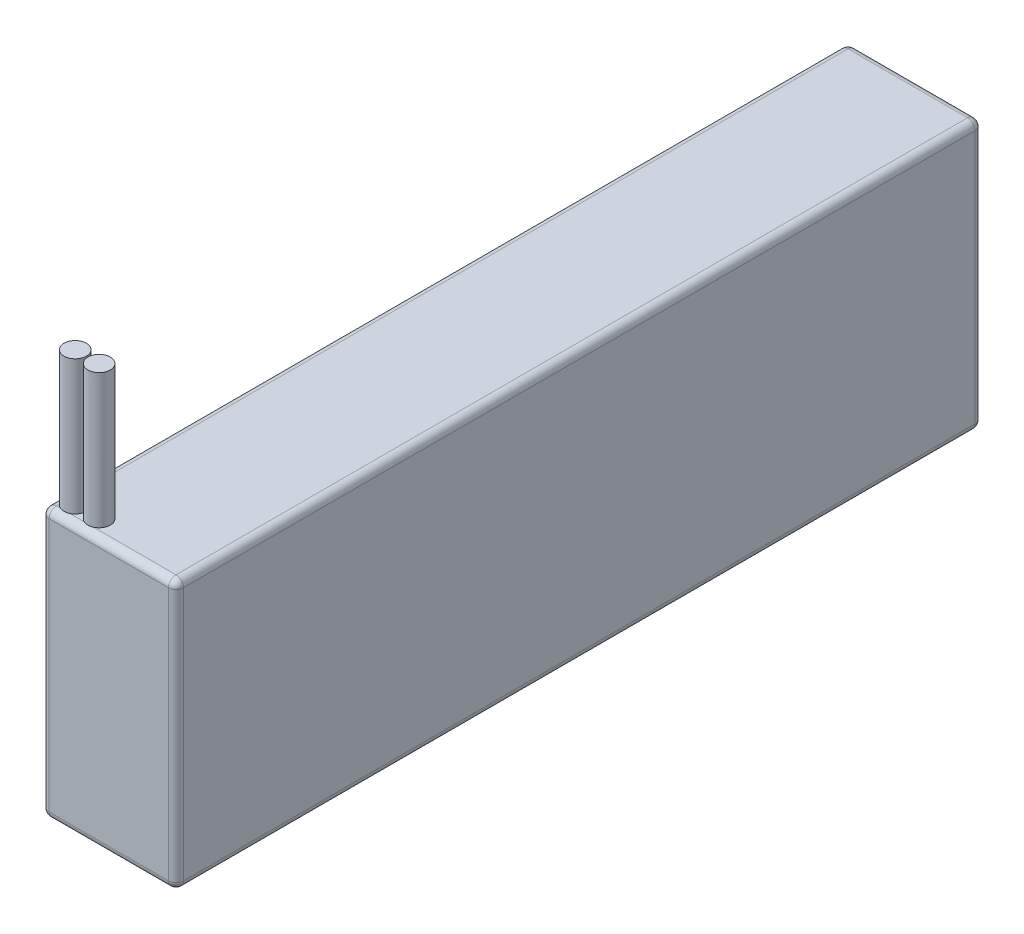
ISO-10303-21;
HEADER;
FILE_DESCRIPTION(('STEP AP214'),'2;1');
FILE_NAME('part.step','',(''),(''),'','','');
FILE_SCHEMA(('AUTOMOTIVE_DESIGN { 1 0 10303 214 1 1 1 1 }'));
ENDSEC;
DATA;
#1=APPLICATION_CONTEXT('core data for automotive mechanical design processes');
#2=APPLICATION_PROTOCOL_DEFINITION('international standard','automotive_design',2000,#1);
#3=PRODUCT_CONTEXT('',#1,'mechanical');
#4=PRODUCT('Part','Part','',(#3));
#5=PRODUCT_RELATED_PRODUCT_CATEGORY('part','',(#4));
#6=PRODUCT_DEFINITION_FORMATION('','',#4);
#7=PRODUCT_DEFINITION_CONTEXT('part definition',#1,'design');
#8=PRODUCT_DEFINITION('design','',#6,#7);
#9=PRODUCT_DEFINITION_SHAPE('','',#8);
#10=(LENGTH_UNIT() NAMED_UNIT(*) SI_UNIT(.MILLI.,.METRE.));
#11=(NAMED_UNIT(*) PLANE_ANGLE_UNIT() SI_UNIT($,.RADIAN.));
#12=(NAMED_UNIT(*) SI_UNIT($,.STERADIAN.) SOLID_ANGLE_UNIT());
#13=UNCERTAINTY_MEASURE_WITH_UNIT(LENGTH_MEASURE(1.E-05),#10,'distance_accuracy_value','');
#14=(GEOMETRIC_REPRESENTATION_CONTEXT(3) GLOBAL_UNCERTAINTY_ASSIGNED_CONTEXT((#13)) GLOBAL_UNIT_ASSIGNED_CONTEXT((#10,
#11,#12)) REPRESENTATION_CONTEXT('',''));
#15=CARTESIAN_POINT('',(0.,0.,0.));
#16=DIRECTION('',(0.,0.,1.));
#17=DIRECTION('',(1.,0.,0.));
#18=AXIS2_PLACEMENT_3D('',#15,#16,#17);
#19=CARTESIAN_POINT('',(22.86,22.86,68.58));
#20=DIRECTION('',(0.,-1.,0.));
#21=DIRECTION('',(0.,0.,-1.));
#22=AXIS2_PLACEMENT_3D('',#19,#20,#21);
#23=PLANE('',#22);
#24=CARTESIAN_POINT('',(2.72264453139453,22.86,65.5854179648613));
#25=DIRECTION('',(0.,1.,0.));
#26=DIRECTION('',(0.,0.,1.));
#27=AXIS2_PLACEMENT_3D('',#24,#25,#26);
#28=CIRCLE('',#27,1.905);
#29=CARTESIAN_POINT('',(1.27,22.86,66.8178338303099));
#30=VERTEX_POINT('',#29);
#31=CARTESIAN_POINT('',(1.91342156825225,22.86,67.31));
#32=VERTEX_POINT('',#31);
#33=EDGE_CURVE('E63',#30,#32,#28,.T.);
#34=ORIENTED_EDGE('',*,*,#33,.F.);
#35=DIRECTION('',(0.,0.,1.));
#36=VECTOR('',#35,1.);
#37=CARTESIAN_POINT('',(1.27,22.86,68.58));
#38=LINE('',#37,#36);
#39=CARTESIAN_POINT('',(1.27,22.86,67.31));
#40=VERTEX_POINT('',#39);
#41=EDGE_CURVE('E235',#30,#40,#38,.T.);
#42=ORIENTED_EDGE('',*,*,#41,.T.);
#43=DIRECTION('',(-1.,0.,0.));
#44=VECTOR('',#43,1.);
#45=CARTESIAN_POINT('',(22.86,22.86,67.31));
#46=LINE('',#45,#44);
#47=EDGE_CURVE('E158',#40,#32,#46,.F.);
#48=ORIENTED_EDGE('',*,*,#47,.T.);
#49=EDGE_LOOP('',(#34,#42,#48));
#50=FACE_BOUND('',#49,.T.);
#51=ADVANCED_FACE('F38',(#50),#23,.F.);
#52=CARTESIAN_POINT('',(22.86,-22.86,-68.58));
#53=DIRECTION('',(0.,0.,1.));
#54=DIRECTION('',(1.,0.,0.));
#55=AXIS2_PLACEMENT_3D('',#52,#53,#54);
#56=PLANE('',#55);
#57=DIRECTION('',(0.,1.,0.));
#58=VECTOR('',#57,1.);
#59=CARTESIAN_POINT('',(21.59,-22.86,-68.58));
#60=LINE('',#59,#58);
#61=CARTESIAN_POINT('',(21.59,21.59,-68.58));
#62=VERTEX_POINT('',#61);
#63=CARTESIAN_POINT('',(21.59,-21.59,-68.58));
#64=VERTEX_POINT('',#63);
#65=EDGE_CURVE('E230',#62,#64,#60,.F.);
#66=ORIENTED_EDGE('',*,*,#65,.T.);
#67=DIRECTION('',(-1.,0.,0.));
#68=VECTOR('',#67,1.);
#69=CARTESIAN_POINT('',(22.86,-21.59,-68.58));
#70=LINE('',#69,#68);
#71=CARTESIAN_POINT('',(1.27,-21.59,-68.58));
#72=VERTEX_POINT('',#71);
#73=EDGE_CURVE('E232',#64,#72,#70,.T.);
#74=ORIENTED_EDGE('',*,*,#73,.T.);
#75=DIRECTION('',(0.,1.,0.));
#76=VECTOR('',#75,1.);
#77=CARTESIAN_POINT('',(1.27,22.86,-68.58));
#78=LINE('',#77,#76);
#79=CARTESIAN_POINT('',(1.27,21.59,-68.58));
#80=VERTEX_POINT('',#79);
#81=EDGE_CURVE('E228',#72,#80,#78,.T.);
#82=ORIENTED_EDGE('',*,*,#81,.T.);
#83=DIRECTION('',(-1.,0.,0.));
#84=VECTOR('',#83,1.);
#85=CARTESIAN_POINT('',(22.86,21.59,-68.58));
#86=LINE('',#85,#84);
#87=EDGE_CURVE('E226',#80,#62,#86,.F.);
#88=ORIENTED_EDGE('',*,*,#87,.T.);
#89=EDGE_LOOP('',(#66,#74,#82,#88));
#90=FACE_BOUND('',#89,.T.);
#91=ADVANCED_FACE('F352',(#90),#56,.F.);
#92=CARTESIAN_POINT('',(6.78664453139453,22.86,65.5854179648613));
#93=DIRECTION('',(0.,1.,0.));
#94=DIRECTION('',(0.,0.,1.));
#95=AXIS2_PLACEMENT_3D('',#92,#93,#94);
#96=CIRCLE('',#95,1.90500000000001);
#97=CARTESIAN_POINT('',(7.59586749453682,22.86,67.31));
#98=VERTEX_POINT('',#97);
#99=CARTESIAN_POINT('',(5.97742156825224,22.86,67.31));
#100=VERTEX_POINT('',#99);
#101=EDGE_CURVE('E160',#98,#100,#96,.T.);
#102=ORIENTED_EDGE('',*,*,#101,.F.);
#103=CARTESIAN_POINT('',(21.59,22.86,67.31));
#104=VERTEX_POINT('',#103);
#105=EDGE_CURVE('E146',#98,#104,#46,.F.);
#106=ORIENTED_EDGE('',*,*,#105,.T.);
#107=DIRECTION('',(0.,0.,1.));
#108=VECTOR('',#107,1.);
#109=CARTESIAN_POINT('',(21.59,22.86,68.58));
#110=LINE('',#109,#108);
#111=CARTESIAN_POINT('',(21.59,22.86,-67.31));
#112=VERTEX_POINT('',#111);
#113=EDGE_CURVE('E47',#104,#112,#110,.F.);
#114=ORIENTED_EDGE('',*,*,#113,.T.);
#115=DIRECTION('',(-1.,0.,0.));
#116=VECTOR('',#115,1.);
#117=CARTESIAN_POINT('',(22.86,22.86,-67.31));
#118=LINE('',#117,#116);
#119=CARTESIAN_POINT('',(1.27,22.86,-67.31));
#120=VERTEX_POINT('',#119);
#121=EDGE_CURVE('E11',#112,#120,#118,.T.);
#122=ORIENTED_EDGE('',*,*,#121,.T.);
#123=CARTESIAN_POINT('',(1.27,22.86,64.3530020994126));
#124=VERTEX_POINT('',#123);
#125=EDGE_CURVE('E156',#120,#124,#38,.T.);
#126=ORIENTED_EDGE('',*,*,#125,.T.);
#127=CARTESIAN_POINT('',(3.53186749453681,22.86,67.31));
#128=VERTEX_POINT('',#127);
#129=EDGE_CURVE('E180',#128,#124,#28,.T.);
#130=ORIENTED_EDGE('',*,*,#129,.F.);
#131=EDGE_CURVE('E163',#128,#100,#46,.F.);
#132=ORIENTED_EDGE('',*,*,#131,.T.);
#133=EDGE_LOOP('',(#102,#106,#114,#122,#126,#130,#132));
#134=FACE_BOUND('',#133,.T.);
#135=ADVANCED_FACE('F161',(#134),#23,.F.);
#136=CARTESIAN_POINT('',(22.86,-22.86,68.58));
#137=DIRECTION('',(0.,0.,-1.));
#138=DIRECTION('',(-1.,0.,0.));
#139=AXIS2_PLACEMENT_3D('',#136,#137,#138);
#140=PLANE('',#139);
#141=DIRECTION('',(-1.,0.,0.));
#142=VECTOR('',#141,1.);
#143=CARTESIAN_POINT('',(22.86,-21.59,68.58));
#144=LINE('',#143,#142);
#145=CARTESIAN_POINT('',(1.27,-21.59,68.58));
#146=VERTEX_POINT('',#145);
#147=CARTESIAN_POINT('',(21.59,-21.59,68.58));
#148=VERTEX_POINT('',#147);
#149=EDGE_CURVE('E221',#146,#148,#144,.F.);
#150=ORIENTED_EDGE('',*,*,#149,.T.);
#151=DIRECTION('',(0.,-1.,0.));
#152=VECTOR('',#151,1.);
#153=CARTESIAN_POINT('',(21.59,-22.86,68.58));
#154=LINE('',#153,#152);
#155=CARTESIAN_POINT('',(21.59,21.59,68.58));
#156=VERTEX_POINT('',#155);
#157=EDGE_CURVE('E223',#148,#156,#154,.F.);
#158=ORIENTED_EDGE('',*,*,#157,.T.);
#159=DIRECTION('',(-1.,0.,0.));
#160=VECTOR('',#159,1.);
#161=CARTESIAN_POINT('',(22.86,21.59,68.58));
#162=LINE('',#161,#160);
#163=CARTESIAN_POINT('',(1.27,21.59,68.58));
#164=VERTEX_POINT('',#163);
#165=EDGE_CURVE('E217',#156,#164,#162,.T.);
#166=ORIENTED_EDGE('',*,*,#165,.T.);
#167=DIRECTION('',(0.,-1.,0.));
#168=VECTOR('',#167,1.);
#169=CARTESIAN_POINT('',(1.27,-22.86,68.58));
#170=LINE('',#169,#168);
#171=EDGE_CURVE('E219',#164,#146,#170,.T.);
#172=ORIENTED_EDGE('',*,*,#171,.T.);
#173=EDGE_LOOP('',(#150,#158,#166,#172));
#174=FACE_BOUND('',#173,.T.);
#175=ADVANCED_FACE('F318',(#174),#140,.F.);
#176=CARTESIAN_POINT('',(22.86,-22.86,68.58));
#177=DIRECTION('',(0.,1.,0.));
#178=DIRECTION('',(0.,0.,1.));
#179=AXIS2_PLACEMENT_3D('',#176,#177,#178);
#180=PLANE('',#179);
#181=DIRECTION('',(0.,0.,-1.));
#182=VECTOR('',#181,1.);
#183=CARTESIAN_POINT('',(21.59,-22.86,68.58));
#184=LINE('',#183,#182);
#185=CARTESIAN_POINT('',(21.59,-22.86,-67.31));
#186=VERTEX_POINT('',#185);
#187=CARTESIAN_POINT('',(21.59,-22.86,67.31));
#188=VERTEX_POINT('',#187);
#189=EDGE_CURVE('E203',#186,#188,#184,.F.);
#190=ORIENTED_EDGE('',*,*,#189,.T.);
#191=DIRECTION('',(-1.,0.,0.));
#192=VECTOR('',#191,1.);
#193=CARTESIAN_POINT('',(22.86,-22.86,67.31));
#194=LINE('',#193,#192);
#195=CARTESIAN_POINT('',(1.27,-22.86,67.31));
#196=VERTEX_POINT('',#195);
#197=EDGE_CURVE('E206',#188,#196,#194,.T.);
#198=ORIENTED_EDGE('',*,*,#197,.T.);
#199=DIRECTION('',(0.,0.,-1.));
#200=VECTOR('',#199,1.);
#201=CARTESIAN_POINT('',(1.27,-22.86,-68.58));
#202=LINE('',#201,#200);
#203=CARTESIAN_POINT('',(1.27,-22.86,-67.31));
#204=VERTEX_POINT('',#203);
#205=EDGE_CURVE('E201',#196,#204,#202,.T.);
#206=ORIENTED_EDGE('',*,*,#205,.T.);
#207=DIRECTION('',(-1.,0.,0.));
#208=VECTOR('',#207,1.);
#209=CARTESIAN_POINT('',(22.86,-22.86,-67.31));
#210=LINE('',#209,#208);
#211=EDGE_CURVE('E198',#204,#186,#210,.F.);
#212=ORIENTED_EDGE('',*,*,#211,.T.);
#213=EDGE_LOOP('',(#190,#198,#206,#212));
#214=FACE_BOUND('',#213,.T.);
#215=ADVANCED_FACE('F386',(#214),#180,.F.);
#216=CARTESIAN_POINT('',(22.86,0.,0.));
#217=DIRECTION('',(-1.,0.,0.));
#218=DIRECTION('',(0.,0.,1.));
#219=AXIS2_PLACEMENT_3D('',#216,#217,#218);
#220=PLANE('',#219);
#221=DIRECTION('',(0.,-1.,0.));
#222=VECTOR('',#221,1.);
#223=CARTESIAN_POINT('',(22.86,0.,67.31));
#224=LINE('',#223,#222);
#225=CARTESIAN_POINT('',(22.86,21.59,67.31));
#226=VERTEX_POINT('',#225);
#227=CARTESIAN_POINT('',(22.86,-21.59,67.31));
#228=VERTEX_POINT('',#227);
#229=EDGE_CURVE('E193',#226,#228,#224,.T.);
#230=ORIENTED_EDGE('',*,*,#229,.T.);
#231=DIRECTION('',(0.,0.,-1.));
#232=VECTOR('',#231,1.);
#233=CARTESIAN_POINT('',(22.86,-21.59,0.));
#234=LINE('',#233,#232);
#235=CARTESIAN_POINT('',(22.86,-21.59,-67.31));
#236=VERTEX_POINT('',#235);
#237=EDGE_CURVE('E195',#228,#236,#234,.T.);
#238=ORIENTED_EDGE('',*,*,#237,.T.);
#239=DIRECTION('',(0.,1.,0.));
#240=VECTOR('',#239,1.);
#241=CARTESIAN_POINT('',(22.86,0.,-67.31));
#242=LINE('',#241,#240);
#243=CARTESIAN_POINT('',(22.86,21.59,-67.31));
#244=VERTEX_POINT('',#243);
#245=EDGE_CURVE('E190',#236,#244,#242,.T.);
#246=ORIENTED_EDGE('',*,*,#245,.T.);
#247=DIRECTION('',(0.,0.,1.));
#248=VECTOR('',#247,1.);
#249=CARTESIAN_POINT('',(22.86,21.59,0.));
#250=LINE('',#249,#248);
#251=EDGE_CURVE('E188',#244,#226,#250,.T.);
#252=ORIENTED_EDGE('',*,*,#251,.T.);
#253=EDGE_LOOP('',(#230,#238,#246,#252));
#254=FACE_BOUND('',#253,.T.);
#255=ADVANCED_FACE('F390',(#254),#220,.F.);
#256=CARTESIAN_POINT('',(0.,0.,0.));
#257=DIRECTION('',(-1.,0.,0.));
#258=DIRECTION('',(0.,0.,1.));
#259=AXIS2_PLACEMENT_3D('',#256,#257,#258);
#260=PLANE('',#259);
#261=DIRECTION('',(0.,1.,0.));
#262=VECTOR('',#261,1.);
#263=CARTESIAN_POINT('',(0.,-22.86,-67.31));
#264=LINE('',#263,#262);
#265=CARTESIAN_POINT('',(0.,21.59,-67.31));
#266=VERTEX_POINT('',#265);
#267=CARTESIAN_POINT('',(0.,-21.59,-67.31));
#268=VERTEX_POINT('',#267);
#269=EDGE_CURVE('E210',#266,#268,#264,.F.);
#270=ORIENTED_EDGE('',*,*,#269,.T.);
#271=DIRECTION('',(0.,0.,-1.));
#272=VECTOR('',#271,1.);
#273=CARTESIAN_POINT('',(0.,-21.59,68.58));
#274=LINE('',#273,#272);
#275=CARTESIAN_POINT('',(0.,-21.59,67.31));
#276=VERTEX_POINT('',#275);
#277=EDGE_CURVE('E214',#268,#276,#274,.F.);
#278=ORIENTED_EDGE('',*,*,#277,.T.);
#279=DIRECTION('',(0.,-1.,0.));
#280=VECTOR('',#279,1.);
#281=CARTESIAN_POINT('',(0.,22.86,67.31));
#282=LINE('',#281,#280);
#283=CARTESIAN_POINT('',(0.,21.59,67.31));
#284=VERTEX_POINT('',#283);
#285=EDGE_CURVE('E212',#276,#284,#282,.F.);
#286=ORIENTED_EDGE('',*,*,#285,.T.);
#287=DIRECTION('',(0.,0.,1.));
#288=VECTOR('',#287,1.);
#289=CARTESIAN_POINT('',(0.,21.59,-68.58));
#290=LINE('',#289,#288);
#291=EDGE_CURVE('E208',#284,#266,#290,.F.);
#292=ORIENTED_EDGE('',*,*,#291,.T.);
#293=EDGE_LOOP('',(#270,#278,#286,#292));
#294=FACE_BOUND('',#293,.T.);
#295=ADVANCED_FACE('F394',(#294),#260,.T.);
#296=CARTESIAN_POINT('',(1.27,21.59,68.58));
#297=DIRECTION('',(0.,0.,-1.));
#298=DIRECTION('',(-1.,0.,0.));
#299=AXIS2_PLACEMENT_3D('',#296,#297,#298);
#300=CYLINDRICAL_SURFACE('',#299,1.27);
#301=CARTESIAN_POINT('',(1.27,21.59,67.31));
#302=DIRECTION('',(0.,0.,1.));
#303=DIRECTION('',(1.,0.,0.));
#304=AXIS2_PLACEMENT_3D('',#301,#302,#303);
#305=CIRCLE('',#304,1.27);
#306=EDGE_CURVE('E42',#40,#284,#305,.T.);
#307=ORIENTED_EDGE('',*,*,#306,.F.);
#308=ORIENTED_EDGE('',*,*,#41,.F.);
#309=DIRECTION('',(0.,0.,-1.));
#310=VECTOR('',#309,1.);
#311=CARTESIAN_POINT('',(1.27,22.86,68.58));
#312=LINE('',#311,#310);
#313=EDGE_CURVE('E179',#124,#30,#312,.F.);
#314=ORIENTED_EDGE('',*,*,#313,.F.);
#315=ORIENTED_EDGE('',*,*,#125,.F.);
#316=CARTESIAN_POINT('',(1.27,21.59,-67.31));
#317=DIRECTION('',(0.,0.,-1.));
#318=DIRECTION('',(-1.,0.,0.));
#319=AXIS2_PLACEMENT_3D('',#316,#317,#318);
#320=CIRCLE('',#319,1.27);
#321=EDGE_CURVE('E295',#266,#120,#320,.T.);
#322=ORIENTED_EDGE('',*,*,#321,.F.);
#323=ORIENTED_EDGE('',*,*,#291,.F.);
#324=EDGE_LOOP('',(#307,#308,#314,#315,#322,#323));
#325=FACE_BOUND('',#324,.T.);
#326=ADVANCED_FACE('F40',(#325),#300,.T.);
#327=CARTESIAN_POINT('',(1.27,21.59,67.31));
#328=DIRECTION('',(0.,0.,1.));
#329=DIRECTION('',(1.,0.,0.));
#330=AXIS2_PLACEMENT_3D('',#327,#328,#329);
#331=SPHERICAL_SURFACE('',#330,1.27);
#332=CARTESIAN_POINT('',(1.27,21.59,67.31));
#333=DIRECTION('',(-1.,0.,0.));
#334=DIRECTION('',(0.,0.,1.));
#335=AXIS2_PLACEMENT_3D('',#332,#333,#334);
#336=CIRCLE('',#335,1.27);
#337=EDGE_CURVE('E291',#40,#164,#336,.F.);
#338=ORIENTED_EDGE('',*,*,#337,.F.);
#339=ORIENTED_EDGE('',*,*,#306,.T.);
#340=CARTESIAN_POINT('',(1.27,21.59,67.31));
#341=DIRECTION('',(0.,1.,0.));
#342=DIRECTION('',(0.,0.,1.));
#343=AXIS2_PLACEMENT_3D('',#340,#341,#342);
#344=CIRCLE('',#343,1.27);
#345=EDGE_CURVE('E293',#164,#284,#344,.F.);
#346=ORIENTED_EDGE('',*,*,#345,.F.);
#347=EDGE_LOOP('',(#338,#339,#346));
#348=FACE_BOUND('',#347,.T.);
#349=ADVANCED_FACE('F307',(#348),#331,.T.);
#350=CARTESIAN_POINT('',(1.27,21.59,-67.31));
#351=DIRECTION('',(0.,0.,1.));
#352=DIRECTION('',(1.,0.,0.));
#353=AXIS2_PLACEMENT_3D('',#350,#351,#352);
#354=SPHERICAL_SURFACE('',#353,1.27);
#355=CARTESIAN_POINT('',(1.27,21.59,-67.31));
#356=DIRECTION('',(0.,1.,0.));
#357=DIRECTION('',(0.,0.,1.));
#358=AXIS2_PLACEMENT_3D('',#355,#356,#357);
#359=CIRCLE('',#358,1.27);
#360=EDGE_CURVE('E286',#266,#80,#359,.F.);
#361=ORIENTED_EDGE('',*,*,#360,.F.);
#362=ORIENTED_EDGE('',*,*,#321,.T.);
#363=CARTESIAN_POINT('',(1.27,21.59,-67.31));
#364=DIRECTION('',(-1.,0.,0.));
#365=DIRECTION('',(0.,0.,1.));
#366=AXIS2_PLACEMENT_3D('',#363,#364,#365);
#367=CIRCLE('',#366,1.27);
#368=EDGE_CURVE('E289',#80,#120,#367,.F.);
#369=ORIENTED_EDGE('',*,*,#368,.F.);
#370=EDGE_LOOP('',(#361,#362,#369));
#371=FACE_BOUND('',#370,.T.);
#372=ADVANCED_FACE('F367',(#371),#354,.T.);
#373=CARTESIAN_POINT('',(1.27,-22.86,67.31));
#374=DIRECTION('',(0.,1.,0.));
#375=DIRECTION('',(0.,0.,1.));
#376=AXIS2_PLACEMENT_3D('',#373,#374,#375);
#377=CYLINDRICAL_SURFACE('',#376,1.27);
#378=ORIENTED_EDGE('',*,*,#345,.T.);
#379=ORIENTED_EDGE('',*,*,#285,.F.);
#380=CARTESIAN_POINT('',(1.27,-21.59,67.31));
#381=DIRECTION('',(0.,-1.,0.));
#382=DIRECTION('',(0.,0.,-1.));
#383=AXIS2_PLACEMENT_3D('',#380,#381,#382);
#384=CIRCLE('',#383,1.27);
#385=EDGE_CURVE('E281',#146,#276,#384,.T.);
#386=ORIENTED_EDGE('',*,*,#385,.F.);
#387=ORIENTED_EDGE('',*,*,#171,.F.);
#388=EDGE_LOOP('',(#378,#379,#386,#387));
#389=FACE_BOUND('',#388,.T.);
#390=ADVANCED_FACE('F314',(#389),#377,.T.);
#391=CARTESIAN_POINT('',(22.86,21.59,67.31));
#392=DIRECTION('',(-1.,0.,0.));
#393=DIRECTION('',(0.,0.,1.));
#394=AXIS2_PLACEMENT_3D('',#391,#392,#393);
#395=CYLINDRICAL_SURFACE('',#394,1.27);
#396=ORIENTED_EDGE('',*,*,#337,.T.);
#397=ORIENTED_EDGE('',*,*,#165,.F.);
#398=CARTESIAN_POINT('',(21.59,21.59,67.31));
#399=DIRECTION('',(1.,0.,0.));
#400=DIRECTION('',(0.,0.,-1.));
#401=AXIS2_PLACEMENT_3D('',#398,#399,#400);
#402=CIRCLE('',#401,1.27);
#403=EDGE_CURVE('E152',#104,#156,#402,.T.);
#404=ORIENTED_EDGE('',*,*,#403,.F.);
#405=ORIENTED_EDGE('',*,*,#105,.F.);
#406=EDGE_CURVE('E55',#100,#98,#46,.F.);
#407=ORIENTED_EDGE('',*,*,#406,.F.);
#408=ORIENTED_EDGE('',*,*,#131,.F.);
#409=EDGE_CURVE('E238',#32,#128,#46,.F.);
#410=ORIENTED_EDGE('',*,*,#409,.F.);
#411=ORIENTED_EDGE('',*,*,#47,.F.);
#412=EDGE_LOOP('',(#396,#397,#404,#405,#407,#408,#410,#411));
#413=FACE_BOUND('',#412,.T.);
#414=ADVANCED_FACE('F149',(#413),#395,.T.);
#415=CARTESIAN_POINT('',(21.59,21.59,0.));
#416=DIRECTION('',(0.,0.,1.));
#417=DIRECTION('',(1.,0.,0.));
#418=AXIS2_PLACEMENT_3D('',#415,#416,#417);
#419=CYLINDRICAL_SURFACE('',#418,1.27);
#420=CARTESIAN_POINT('',(21.59,21.59,-67.31));
#421=DIRECTION('',(0.,0.,-1.));
#422=DIRECTION('',(-1.,0.,0.));
#423=AXIS2_PLACEMENT_3D('',#420,#421,#422);
#424=CIRCLE('',#423,1.27);
#425=EDGE_CURVE('E274',#112,#244,#424,.T.);
#426=ORIENTED_EDGE('',*,*,#425,.F.);
#427=ORIENTED_EDGE('',*,*,#113,.F.);
#428=CARTESIAN_POINT('',(21.59,21.59,67.31));
#429=DIRECTION('',(0.,0.,1.));
#430=DIRECTION('',(1.,0.,0.));
#431=AXIS2_PLACEMENT_3D('',#428,#429,#430);
#432=CIRCLE('',#431,1.27);
#433=EDGE_CURVE('E277',#226,#104,#432,.T.);
#434=ORIENTED_EDGE('',*,*,#433,.F.);
#435=ORIENTED_EDGE('',*,*,#251,.F.);
#436=EDGE_LOOP('',(#426,#427,#434,#435));
#437=FACE_BOUND('',#436,.T.);
#438=ADVANCED_FACE('F341',(#437),#419,.T.);
#439=CARTESIAN_POINT('',(22.86,21.59,-67.31));
#440=DIRECTION('',(-1.,0.,0.));
#441=DIRECTION('',(0.,0.,1.));
#442=AXIS2_PLACEMENT_3D('',#439,#440,#441);
#443=CYLINDRICAL_SURFACE('',#442,1.27);
#444=ORIENTED_EDGE('',*,*,#368,.T.);
#445=ORIENTED_EDGE('',*,*,#121,.F.);
#446=CARTESIAN_POINT('',(21.59,21.59,-67.31));
#447=DIRECTION('',(1.,0.,0.));
#448=DIRECTION('',(0.,0.,-1.));
#449=AXIS2_PLACEMENT_3D('',#446,#447,#448);
#450=CIRCLE('',#449,1.27);
#451=EDGE_CURVE('E271',#62,#112,#450,.T.);
#452=ORIENTED_EDGE('',*,*,#451,.F.);
#453=ORIENTED_EDGE('',*,*,#87,.F.);
#454=EDGE_LOOP('',(#444,#445,#452,#453));
#455=FACE_BOUND('',#454,.T.);
#456=ADVANCED_FACE('F336',(#455),#443,.T.);
#457=CARTESIAN_POINT('',(1.27,-22.86,-67.31));
#458=DIRECTION('',(0.,-1.,0.));
#459=DIRECTION('',(0.,0.,-1.));
#460=AXIS2_PLACEMENT_3D('',#457,#458,#459);
#461=CYLINDRICAL_SURFACE('',#460,1.27);
#462=ORIENTED_EDGE('',*,*,#360,.T.);
#463=ORIENTED_EDGE('',*,*,#81,.F.);
#464=CARTESIAN_POINT('',(1.27,-21.59,-67.31));
#465=DIRECTION('',(0.,-1.,0.));
#466=DIRECTION('',(0.,0.,-1.));
#467=AXIS2_PLACEMENT_3D('',#464,#465,#466);
#468=CIRCLE('',#467,1.27);
#469=EDGE_CURVE('E268',#268,#72,#468,.T.);
#470=ORIENTED_EDGE('',*,*,#469,.F.);
#471=ORIENTED_EDGE('',*,*,#269,.F.);
#472=EDGE_LOOP('',(#462,#463,#470,#471));
#473=FACE_BOUND('',#472,.T.);
#474=ADVANCED_FACE('F366',(#473),#461,.T.);
#475=CARTESIAN_POINT('',(1.27,-21.59,68.58));
#476=DIRECTION('',(0.,0.,1.));
#477=DIRECTION('',(1.,0.,0.));
#478=AXIS2_PLACEMENT_3D('',#475,#476,#477);
#479=CYLINDRICAL_SURFACE('',#478,1.27);
#480=CARTESIAN_POINT('',(1.27,-21.59,67.31));
#481=DIRECTION('',(0.,0.,1.));
#482=DIRECTION('',(1.,0.,0.));
#483=AXIS2_PLACEMENT_3D('',#480,#481,#482);
#484=CIRCLE('',#483,1.27);
#485=EDGE_CURVE('E283',#276,#196,#484,.T.);
#486=ORIENTED_EDGE('',*,*,#485,.F.);
#487=ORIENTED_EDGE('',*,*,#277,.F.);
#488=CARTESIAN_POINT('',(1.27,-21.59,-67.31));
#489=DIRECTION('',(0.,0.,-1.));
#490=DIRECTION('',(-1.,0.,0.));
#491=AXIS2_PLACEMENT_3D('',#488,#489,#490);
#492=CIRCLE('',#491,1.27);
#493=EDGE_CURVE('E265',#204,#268,#492,.T.);
#494=ORIENTED_EDGE('',*,*,#493,.F.);
#495=ORIENTED_EDGE('',*,*,#205,.F.);
#496=EDGE_LOOP('',(#486,#487,#494,#495));
#497=FACE_BOUND('',#496,.T.);
#498=ADVANCED_FACE('F517',(#497),#479,.T.);
#499=CARTESIAN_POINT('',(1.27,-21.59,67.31));
#500=DIRECTION('',(0.,0.,1.));
#501=DIRECTION('',(1.,0.,0.));
#502=AXIS2_PLACEMENT_3D('',#499,#500,#501);
#503=SPHERICAL_SURFACE('',#502,1.27);
#504=ORIENTED_EDGE('',*,*,#385,.T.);
#505=ORIENTED_EDGE('',*,*,#485,.T.);
#506=CARTESIAN_POINT('',(1.27,-21.59,67.31));
#507=DIRECTION('',(-1.,0.,0.));
#508=DIRECTION('',(0.,0.,1.));
#509=AXIS2_PLACEMENT_3D('',#506,#507,#508);
#510=CIRCLE('',#509,1.27);
#511=EDGE_CURVE('E262',#146,#196,#510,.F.);
#512=ORIENTED_EDGE('',*,*,#511,.F.);
#513=EDGE_LOOP('',(#504,#505,#512));
#514=FACE_BOUND('',#513,.T.);
#515=ADVANCED_FACE('F525',(#514),#503,.T.);
#516=CARTESIAN_POINT('',(21.59,21.59,67.31));
#517=DIRECTION('',(0.,0.,1.));
#518=DIRECTION('',(1.,0.,0.));
#519=AXIS2_PLACEMENT_3D('',#516,#517,#518);
#520=SPHERICAL_SURFACE('',#519,1.27);
#521=ORIENTED_EDGE('',*,*,#433,.T.);
#522=ORIENTED_EDGE('',*,*,#403,.T.);
#523=CARTESIAN_POINT('',(21.59,21.59,67.31));
#524=DIRECTION('',(0.,1.,0.));
#525=DIRECTION('',(0.,0.,1.));
#526=AXIS2_PLACEMENT_3D('',#523,#524,#525);
#527=CIRCLE('',#526,1.27);
#528=EDGE_CURVE('E260',#226,#156,#527,.F.);
#529=ORIENTED_EDGE('',*,*,#528,.F.);
#530=EDGE_LOOP('',(#521,#522,#529));
#531=FACE_BOUND('',#530,.T.);
#532=ADVANCED_FACE('F534',(#531),#520,.T.);
#533=CARTESIAN_POINT('',(21.59,21.59,-67.31));
#534=DIRECTION('',(0.,0.,1.));
#535=DIRECTION('',(1.,0.,0.));
#536=AXIS2_PLACEMENT_3D('',#533,#534,#535);
#537=SPHERICAL_SURFACE('',#536,1.27);
#538=ORIENTED_EDGE('',*,*,#451,.T.);
#539=ORIENTED_EDGE('',*,*,#425,.T.);
#540=CARTESIAN_POINT('',(21.59,21.59,-67.31));
#541=DIRECTION('',(0.,1.,0.));
#542=DIRECTION('',(0.,0.,1.));
#543=AXIS2_PLACEMENT_3D('',#540,#541,#542);
#544=CIRCLE('',#543,1.27);
#545=EDGE_CURVE('E257',#62,#244,#544,.F.);
#546=ORIENTED_EDGE('',*,*,#545,.F.);
#547=EDGE_LOOP('',(#538,#539,#546));
#548=FACE_BOUND('',#547,.T.);
#549=ADVANCED_FACE('F344',(#548),#537,.T.);
#550=CARTESIAN_POINT('',(1.27,-21.59,-67.31));
#551=DIRECTION('',(0.,0.,1.));
#552=DIRECTION('',(1.,0.,0.));
#553=AXIS2_PLACEMENT_3D('',#550,#551,#552);
#554=SPHERICAL_SURFACE('',#553,1.27);
#555=ORIENTED_EDGE('',*,*,#493,.T.);
#556=ORIENTED_EDGE('',*,*,#469,.T.);
#557=CARTESIAN_POINT('',(1.27,-21.59,-67.31));
#558=DIRECTION('',(-1.,0.,0.));
#559=DIRECTION('',(0.,0.,1.));
#560=AXIS2_PLACEMENT_3D('',#557,#558,#559);
#561=CIRCLE('',#560,1.27);
#562=EDGE_CURVE('E255',#204,#72,#561,.F.);
#563=ORIENTED_EDGE('',*,*,#562,.F.);
#564=EDGE_LOOP('',(#555,#556,#563));
#565=FACE_BOUND('',#564,.T.);
#566=ADVANCED_FACE('F362',(#565),#554,.T.);
#567=CARTESIAN_POINT('',(22.86,-21.59,67.31));
#568=DIRECTION('',(-1.,0.,0.));
#569=DIRECTION('',(0.,0.,1.));
#570=AXIS2_PLACEMENT_3D('',#567,#568,#569);
#571=CYLINDRICAL_SURFACE('',#570,1.27);
#572=ORIENTED_EDGE('',*,*,#511,.T.);
#573=ORIENTED_EDGE('',*,*,#197,.F.);
#574=CARTESIAN_POINT('',(21.59,-21.59,67.31));
#575=DIRECTION('',(1.,0.,0.));
#576=DIRECTION('',(0.,0.,-1.));
#577=AXIS2_PLACEMENT_3D('',#574,#575,#576);
#578=CIRCLE('',#577,1.27);
#579=EDGE_CURVE('E252',#148,#188,#578,.T.);
#580=ORIENTED_EDGE('',*,*,#579,.F.);
#581=ORIENTED_EDGE('',*,*,#149,.F.);
#582=EDGE_LOOP('',(#572,#573,#580,#581));
#583=FACE_BOUND('',#582,.T.);
#584=ADVANCED_FACE('F558',(#583),#571,.T.);
#585=CARTESIAN_POINT('',(21.59,0.,67.31));
#586=DIRECTION('',(0.,-1.,0.));
#587=DIRECTION('',(0.,0.,-1.));
#588=AXIS2_PLACEMENT_3D('',#585,#586,#587);
#589=CYLINDRICAL_SURFACE('',#588,1.27);
#590=ORIENTED_EDGE('',*,*,#528,.T.);
#591=ORIENTED_EDGE('',*,*,#157,.F.);
#592=CARTESIAN_POINT('',(21.59,-21.59,67.31));
#593=DIRECTION('',(0.,-1.,0.));
#594=DIRECTION('',(0.,0.,-1.));
#595=AXIS2_PLACEMENT_3D('',#592,#593,#594);
#596=CIRCLE('',#595,1.27);
#597=EDGE_CURVE('E249',#228,#148,#596,.T.);
#598=ORIENTED_EDGE('',*,*,#597,.F.);
#599=ORIENTED_EDGE('',*,*,#229,.F.);
#600=EDGE_LOOP('',(#590,#591,#598,#599));
#601=FACE_BOUND('',#600,.T.);
#602=ADVANCED_FACE('F566',(#601),#589,.T.);
#603=CARTESIAN_POINT('',(21.59,0.,-67.31));
#604=DIRECTION('',(0.,1.,0.));
#605=DIRECTION('',(0.,0.,1.));
#606=AXIS2_PLACEMENT_3D('',#603,#604,#605);
#607=CYLINDRICAL_SURFACE('',#606,1.27);
#608=ORIENTED_EDGE('',*,*,#545,.T.);
#609=ORIENTED_EDGE('',*,*,#245,.F.);
#610=CARTESIAN_POINT('',(21.59,-21.59,-67.31));
#611=DIRECTION('',(0.,-1.,0.));
#612=DIRECTION('',(0.,0.,-1.));
#613=AXIS2_PLACEMENT_3D('',#610,#611,#612);
#614=CIRCLE('',#613,1.27);
#615=EDGE_CURVE('E246',#64,#236,#614,.T.);
#616=ORIENTED_EDGE('',*,*,#615,.F.);
#617=ORIENTED_EDGE('',*,*,#65,.F.);
#618=EDGE_LOOP('',(#608,#609,#616,#617));
#619=FACE_BOUND('',#618,.T.);
#620=ADVANCED_FACE('F349',(#619),#607,.T.);
#621=CARTESIAN_POINT('',(22.86,-21.59,-67.31));
#622=DIRECTION('',(-1.,0.,0.));
#623=DIRECTION('',(0.,0.,1.));
#624=AXIS2_PLACEMENT_3D('',#621,#622,#623);
#625=CYLINDRICAL_SURFACE('',#624,1.27);
#626=ORIENTED_EDGE('',*,*,#562,.T.);
#627=ORIENTED_EDGE('',*,*,#73,.F.);
#628=CARTESIAN_POINT('',(21.59,-21.59,-67.31));
#629=DIRECTION('',(1.,0.,0.));
#630=DIRECTION('',(0.,0.,-1.));
#631=AXIS2_PLACEMENT_3D('',#628,#629,#630);
#632=CIRCLE('',#631,1.27);
#633=EDGE_CURVE('E243',#186,#64,#632,.T.);
#634=ORIENTED_EDGE('',*,*,#633,.F.);
#635=ORIENTED_EDGE('',*,*,#211,.F.);
#636=EDGE_LOOP('',(#626,#627,#634,#635));
#637=FACE_BOUND('',#636,.T.);
#638=ADVANCED_FACE('F355',(#637),#625,.T.);
#639=CARTESIAN_POINT('',(21.59,-21.59,67.31));
#640=DIRECTION('',(0.,0.,1.));
#641=DIRECTION('',(1.,0.,0.));
#642=AXIS2_PLACEMENT_3D('',#639,#640,#641);
#643=SPHERICAL_SURFACE('',#642,1.27);
#644=ORIENTED_EDGE('',*,*,#597,.T.);
#645=ORIENTED_EDGE('',*,*,#579,.T.);
#646=CARTESIAN_POINT('',(21.59,-21.59,67.31));
#647=DIRECTION('',(0.,0.,1.));
#648=DIRECTION('',(1.,0.,0.));
#649=AXIS2_PLACEMENT_3D('',#646,#647,#648);
#650=CIRCLE('',#649,1.27);
#651=EDGE_CURVE('E241',#228,#188,#650,.F.);
#652=ORIENTED_EDGE('',*,*,#651,.F.);
#653=EDGE_LOOP('',(#644,#645,#652));
#654=FACE_BOUND('',#653,.T.);
#655=ADVANCED_FACE('F590',(#654),#643,.T.);
#656=CARTESIAN_POINT('',(21.59,-21.59,-67.31));
#657=DIRECTION('',(0.,0.,1.));
#658=DIRECTION('',(1.,0.,0.));
#659=AXIS2_PLACEMENT_3D('',#656,#657,#658);
#660=SPHERICAL_SURFACE('',#659,1.27);
#661=ORIENTED_EDGE('',*,*,#633,.T.);
#662=ORIENTED_EDGE('',*,*,#615,.T.);
#663=CARTESIAN_POINT('',(21.59,-21.59,-67.31));
#664=DIRECTION('',(0.,0.,-1.));
#665=DIRECTION('',(-1.,0.,0.));
#666=AXIS2_PLACEMENT_3D('',#663,#664,#665);
#667=CIRCLE('',#666,1.27);
#668=EDGE_CURVE('E187',#186,#236,#667,.F.);
#669=ORIENTED_EDGE('',*,*,#668,.F.);
#670=EDGE_LOOP('',(#661,#662,#669));
#671=FACE_BOUND('',#670,.T.);
#672=ADVANCED_FACE('F598',(#671),#660,.T.);
#673=CARTESIAN_POINT('',(21.59,-21.59,0.));
#674=DIRECTION('',(0.,0.,-1.));
#675=DIRECTION('',(-1.,0.,0.));
#676=AXIS2_PLACEMENT_3D('',#673,#674,#675);
#677=CYLINDRICAL_SURFACE('',#676,1.27);
#678=ORIENTED_EDGE('',*,*,#651,.T.);
#679=ORIENTED_EDGE('',*,*,#189,.F.);
#680=ORIENTED_EDGE('',*,*,#668,.T.);
#681=ORIENTED_EDGE('',*,*,#237,.F.);
#682=EDGE_LOOP('',(#678,#679,#680,#681));
#683=FACE_BOUND('',#682,.T.);
#684=ADVANCED_FACE('F407',(#683),#677,.T.);
#685=CARTESIAN_POINT('',(2.72264453139453,22.86,65.5854179648613));
#686=DIRECTION('',(0.,1.,0.));
#687=DIRECTION('',(0.,0.,1.));
#688=AXIS2_PLACEMENT_3D('',#685,#686,#687);
#689=PLANE('',#688);
#690=EDGE_CURVE('E183',#124,#30,#28,.T.);
#691=ORIENTED_EDGE('',*,*,#690,.F.);
#692=ORIENTED_EDGE('',*,*,#313,.T.);
#693=EDGE_LOOP('',(#691,#692));
#694=FACE_BOUND('',#693,.T.);
#695=ADVANCED_FACE('F331',(#694),#689,.F.);
#696=EDGE_CURVE('E184',#32,#128,#28,.T.);
#697=ORIENTED_EDGE('',*,*,#696,.F.);
#698=ORIENTED_EDGE('',*,*,#409,.T.);
#699=EDGE_LOOP('',(#697,#698));
#700=FACE_BOUND('',#699,.T.);
#701=ADVANCED_FACE('F325',(#700),#689,.F.);
#702=CARTESIAN_POINT('',(2.72264453139453,45.72,65.5854179648613));
#703=DIRECTION('',(0.,-1.,0.));
#704=DIRECTION('',(0.,0.,-1.));
#705=AXIS2_PLACEMENT_3D('',#702,#703,#704);
#706=CYLINDRICAL_SURFACE('',#705,1.905);
#707=CARTESIAN_POINT('',(2.72264453139453,45.72,65.5854179648613));
#708=DIRECTION('',(0.,1.,0.));
#709=DIRECTION('',(0.,0.,1.));
#710=AXIS2_PLACEMENT_3D('',#707,#708,#709);
#711=CIRCLE('',#710,1.905);
#712=CARTESIAN_POINT('',(2.72264453139453,45.72,67.4904179648613));
#713=VERTEX_POINT('',#712);
#714=EDGE_CURVE('E175',#713,#713,#711,.T.);
#715=ORIENTED_EDGE('',*,*,#714,.F.);
#716=EDGE_LOOP('',(#715));
#717=FACE_BOUND('',#716,.T.);
#718=ORIENTED_EDGE('',*,*,#129,.T.);
#719=ORIENTED_EDGE('',*,*,#690,.T.);
#720=ORIENTED_EDGE('',*,*,#33,.T.);
#721=ORIENTED_EDGE('',*,*,#696,.T.);
#722=EDGE_LOOP('',(#718,#719,#720,#721));
#723=FACE_BOUND('',#722,.T.);
#724=ADVANCED_FACE('F328',(#717,#723),#706,.T.);
#725=CARTESIAN_POINT('',(2.72264453139453,45.72,65.5854179648613));
#726=DIRECTION('',(0.,1.,0.));
#727=DIRECTION('',(0.,0.,1.));
#728=AXIS2_PLACEMENT_3D('',#725,#726,#727);
#729=PLANE('',#728);
#730=ORIENTED_EDGE('',*,*,#714,.T.);
#731=EDGE_LOOP('',(#730));
#732=FACE_BOUND('',#731,.T.);
#733=ADVANCED_FACE('F403',(#732),#729,.T.);
#734=CARTESIAN_POINT('',(6.78664453139453,22.86,65.5854179648613));
#735=DIRECTION('',(0.,1.,0.));
#736=DIRECTION('',(0.,0.,1.));
#737=AXIS2_PLACEMENT_3D('',#734,#735,#736);
#738=PLANE('',#737);
#739=EDGE_CURVE('E168',#100,#98,#96,.T.);
#740=ORIENTED_EDGE('',*,*,#739,.F.);
#741=ORIENTED_EDGE('',*,*,#406,.T.);
#742=EDGE_LOOP('',(#740,#741));
#743=FACE_BOUND('',#742,.T.);
#744=ADVANCED_FACE('F171',(#743),#738,.F.);
#745=CARTESIAN_POINT('',(6.78664453139453,45.72,65.5854179648613));
#746=DIRECTION('',(0.,-1.,0.));
#747=DIRECTION('',(0.,0.,-1.));
#748=AXIS2_PLACEMENT_3D('',#745,#746,#747);
#749=CYLINDRICAL_SURFACE('',#748,1.90500000000001);
#750=CARTESIAN_POINT('',(6.78664453139453,45.72,65.5854179648613));
#751=DIRECTION('',(0.,1.,0.));
#752=DIRECTION('',(0.,0.,1.));
#753=AXIS2_PLACEMENT_3D('',#750,#751,#752);
#754=CIRCLE('',#753,1.90500000000001);
#755=CARTESIAN_POINT('',(6.78664453139453,45.72,67.4904179648613));
#756=VERTEX_POINT('',#755);
#757=EDGE_CURVE('E167',#756,#756,#754,.T.);
#758=ORIENTED_EDGE('',*,*,#757,.F.);
#759=EDGE_LOOP('',(#758));
#760=FACE_BOUND('',#759,.T.);
#761=ORIENTED_EDGE('',*,*,#101,.T.);
#762=ORIENTED_EDGE('',*,*,#739,.T.);
#763=EDGE_LOOP('',(#761,#762));
#764=FACE_BOUND('',#763,.T.);
#765=ADVANCED_FACE('F172',(#760,#764),#749,.T.);
#766=CARTESIAN_POINT('',(6.78664453139453,45.72,65.5854179648613));
#767=DIRECTION('',(0.,1.,0.));
#768=DIRECTION('',(0.,0.,1.));
#769=AXIS2_PLACEMENT_3D('',#766,#767,#768);
#770=PLANE('',#769);
#771=ORIENTED_EDGE('',*,*,#757,.T.);
#772=EDGE_LOOP('',(#771));
#773=FACE_BOUND('',#772,.T.);
#774=ADVANCED_FACE('F413',(#773),#770,.T.);
#775=CLOSED_SHELL('',(#51,#91,#135,#175,#215,#255,#295,#326,#349,#372,#390,#414,#438,#456,#474,
#498,#515,#532,#549,#566,#584,#602,#620,#638,#655,#672,#684,#695,#701,#724,#733,#744,#765,#774));
#776=MANIFOLD_SOLID_BREP('B2',#775);
#777=ADVANCED_BREP_SHAPE_REPRESENTATION('',(#18,#776),#14);
#778=SHAPE_DEFINITION_REPRESENTATION(#9,#777);
ENDSEC;
END-ISO-10303-21;
